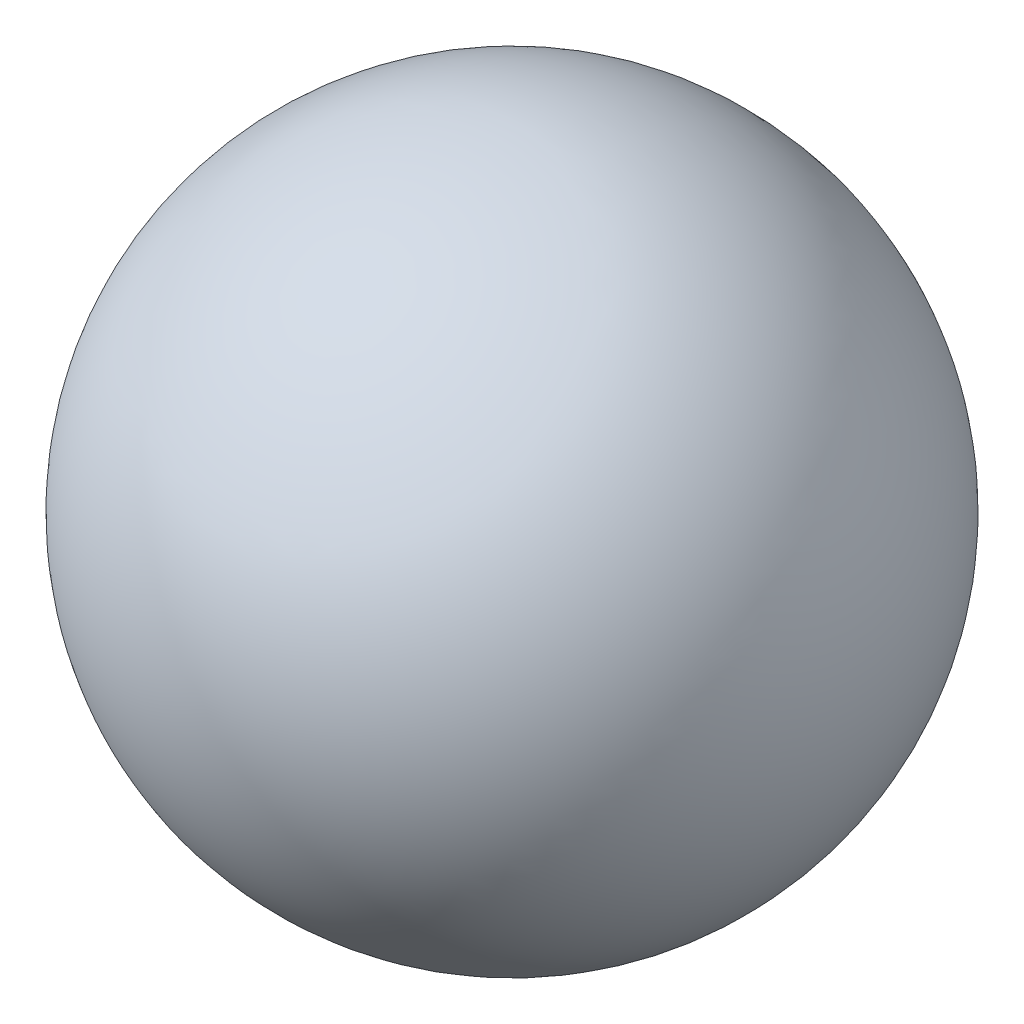
ISO-10303-21;
HEADER;
FILE_DESCRIPTION(('STEP AP214'),'2;1');
FILE_NAME('part.step','',(''),(''),'','','');
FILE_SCHEMA(('AUTOMOTIVE_DESIGN { 1 0 10303 214 1 1 1 1 }'));
ENDSEC;
DATA;
#1=APPLICATION_CONTEXT('core data for automotive mechanical design processes');
#2=APPLICATION_PROTOCOL_DEFINITION('international standard','automotive_design',2000,#1);
#3=PRODUCT_CONTEXT('',#1,'mechanical');
#4=PRODUCT('Part','Part','',(#3));
#5=PRODUCT_RELATED_PRODUCT_CATEGORY('part','',(#4));
#6=PRODUCT_DEFINITION_FORMATION('','',#4);
#7=PRODUCT_DEFINITION_CONTEXT('part definition',#1,'design');
#8=PRODUCT_DEFINITION('design','',#6,#7);
#9=PRODUCT_DEFINITION_SHAPE('','',#8);
#10=(LENGTH_UNIT() NAMED_UNIT(*) SI_UNIT(.MILLI.,.METRE.));
#11=(NAMED_UNIT(*) PLANE_ANGLE_UNIT() SI_UNIT($,.RADIAN.));
#12=(NAMED_UNIT(*) SI_UNIT($,.STERADIAN.) SOLID_ANGLE_UNIT());
#13=UNCERTAINTY_MEASURE_WITH_UNIT(LENGTH_MEASURE(1.E-05),#10,'distance_accuracy_value','');
#14=(GEOMETRIC_REPRESENTATION_CONTEXT(3) GLOBAL_UNCERTAINTY_ASSIGNED_CONTEXT((#13)) GLOBAL_UNIT_ASSIGNED_CONTEXT((#10,
#11,#12)) REPRESENTATION_CONTEXT('',''));
#15=CARTESIAN_POINT('',(0.,0.,0.));
#16=DIRECTION('',(0.,0.,1.));
#17=DIRECTION('',(1.,0.,0.));
#18=AXIS2_PLACEMENT_3D('',#15,#16,#17);
#19=CARTESIAN_POINT('',(49.75,0.462502018146069,-52.9974819414395));
#20=DIRECTION('',(0.,0.00872653549837389,-0.999961923064171));
#21=DIRECTION('',(0.173648177666934,0.984770254550593,0.00859395981573486));
#22=AXIS2_PLACEMENT_3D('',#19,#20,#21);
#23=SPHERICAL_SURFACE('',#22,5.95);
#24=CARTESIAN_POINT('',(49.75,0.514424904361396,-58.9472553836713));
#25=VERTEX_POINT('',#24);
#26=VERTEX_LOOP('',#25);
#27=FACE_BOUND('',#26,.T.);
#28=CARTESIAN_POINT('',(49.75,0.410579131930744,-47.0477084992077));
#29=VERTEX_POINT('',#28);
#30=VERTEX_LOOP('',#29);
#31=FACE_BOUND('',#30,.T.);
#32=ADVANCED_FACE('F16',(#27,#31),#23,.T.);
#33=CLOSED_SHELL('',(#32));
#34=MANIFOLD_SOLID_BREP('B1',#33);
#35=ADVANCED_BREP_SHAPE_REPRESENTATION('',(#18,#34),#14);
#36=SHAPE_DEFINITION_REPRESENTATION(#9,#35);
ENDSEC;
END-ISO-10303-21;
